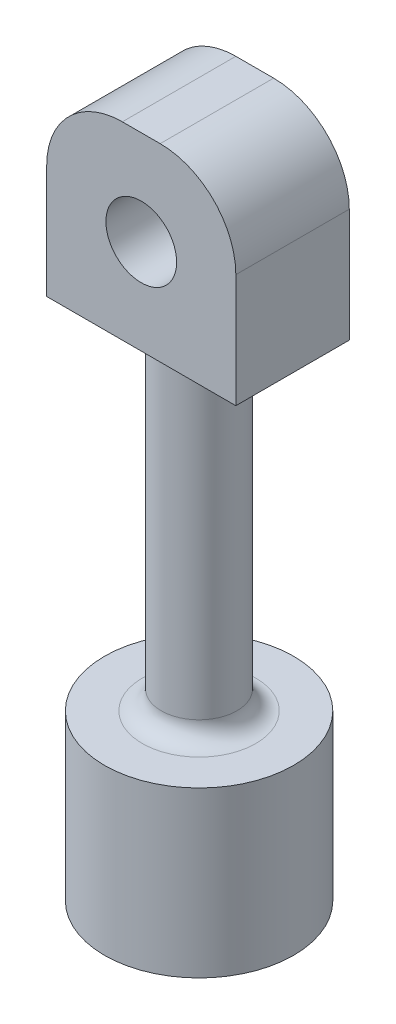
ISO-10303-21;
HEADER;
FILE_DESCRIPTION(('STEP AP214'),'2;1');
FILE_NAME('part.step','',(''),(''),'','','');
FILE_SCHEMA(('AUTOMOTIVE_DESIGN { 1 0 10303 214 1 1 1 1 }'));
ENDSEC;
DATA;
#1=APPLICATION_CONTEXT('core data for automotive mechanical design processes');
#2=APPLICATION_PROTOCOL_DEFINITION('international standard','automotive_design',2000,#1);
#3=PRODUCT_CONTEXT('',#1,'mechanical');
#4=PRODUCT('Part','Part','',(#3));
#5=PRODUCT_RELATED_PRODUCT_CATEGORY('part','',(#4));
#6=PRODUCT_DEFINITION_FORMATION('','',#4);
#7=PRODUCT_DEFINITION_CONTEXT('part definition',#1,'design');
#8=PRODUCT_DEFINITION('design','',#6,#7);
#9=PRODUCT_DEFINITION_SHAPE('','',#8);
#10=(LENGTH_UNIT() NAMED_UNIT(*) SI_UNIT(.MILLI.,.METRE.));
#11=(NAMED_UNIT(*) PLANE_ANGLE_UNIT() SI_UNIT($,.RADIAN.));
#12=(NAMED_UNIT(*) SI_UNIT($,.STERADIAN.) SOLID_ANGLE_UNIT());
#13=UNCERTAINTY_MEASURE_WITH_UNIT(LENGTH_MEASURE(1.E-05),#10,'distance_accuracy_value','');
#14=(GEOMETRIC_REPRESENTATION_CONTEXT(3) GLOBAL_UNCERTAINTY_ASSIGNED_CONTEXT((#13)) GLOBAL_UNIT_ASSIGNED_CONTEXT((#10,
#11,#12)) REPRESENTATION_CONTEXT('',''));
#15=CARTESIAN_POINT('',(0.,0.,0.));
#16=DIRECTION('',(0.,0.,1.));
#17=DIRECTION('',(1.,0.,0.));
#18=AXIS2_PLACEMENT_3D('',#15,#16,#17);
#19=CARTESIAN_POINT('',(0.,0.,3.));
#20=DIRECTION('',(0.,0.,1.));
#21=DIRECTION('',(1.,0.,0.));
#22=AXIS2_PLACEMENT_3D('',#19,#20,#21);
#23=PLANE('',#22);
#24=DIRECTION('',(-1.,0.,0.));
#25=VECTOR('',#24,1.);
#26=CARTESIAN_POINT('',(-2.5,2.5,3.));
#27=LINE('',#26,#25);
#28=CARTESIAN_POINT('',(0.5,2.5,3.));
#29=VERTEX_POINT('',#28);
#30=CARTESIAN_POINT('',(-0.5,2.5,3.));
#31=VERTEX_POINT('',#30);
#32=EDGE_CURVE('E124',#29,#31,#27,.T.);
#33=ORIENTED_EDGE('',*,*,#32,.T.);
#34=CARTESIAN_POINT('',(-0.500000000000001,0.5,3.));
#35=DIRECTION('',(0.,0.,1.));
#36=DIRECTION('',(1.,0.,0.));
#37=AXIS2_PLACEMENT_3D('',#34,#35,#36);
#38=CIRCLE('',#37,2.);
#39=CARTESIAN_POINT('',(-2.5,0.499999999999999,3.));
#40=VERTEX_POINT('',#39);
#41=EDGE_CURVE('E119',#31,#40,#38,.T.);
#42=ORIENTED_EDGE('',*,*,#41,.T.);
#43=DIRECTION('',(0.,-1.,0.));
#44=VECTOR('',#43,1.);
#45=CARTESIAN_POINT('',(-2.5,2.5,3.));
#46=LINE('',#45,#44);
#47=CARTESIAN_POINT('',(-2.5,-2.5,3.));
#48=VERTEX_POINT('',#47);
#49=EDGE_CURVE('E110',#40,#48,#46,.T.);
#50=ORIENTED_EDGE('',*,*,#49,.T.);
#51=DIRECTION('',(1.,0.,0.));
#52=VECTOR('',#51,1.);
#53=CARTESIAN_POINT('',(-2.5,-2.5,3.));
#54=LINE('',#53,#52);
#55=CARTESIAN_POINT('',(2.5,-2.5,3.));
#56=VERTEX_POINT('',#55);
#57=EDGE_CURVE('E116',#48,#56,#54,.T.);
#58=ORIENTED_EDGE('',*,*,#57,.T.);
#59=DIRECTION('',(0.,1.,0.));
#60=VECTOR('',#59,1.);
#61=CARTESIAN_POINT('',(2.5,2.5,3.));
#62=LINE('',#61,#60);
#63=CARTESIAN_POINT('',(2.5,0.5,3.));
#64=VERTEX_POINT('',#63);
#65=EDGE_CURVE('E159',#56,#64,#62,.T.);
#66=ORIENTED_EDGE('',*,*,#65,.T.);
#67=CARTESIAN_POINT('',(0.5,0.5,3.));
#68=DIRECTION('',(0.,0.,1.));
#69=DIRECTION('',(1.,0.,0.));
#70=AXIS2_PLACEMENT_3D('',#67,#68,#69);
#71=CIRCLE('',#70,2.);
#72=EDGE_CURVE('E177',#64,#29,#71,.T.);
#73=ORIENTED_EDGE('',*,*,#72,.T.);
#74=EDGE_LOOP('',(#33,#42,#50,#58,#66,#73));
#75=FACE_BOUND('',#74,.T.);
#76=CARTESIAN_POINT('',(0.,0.,3.));
#77=DIRECTION('',(0.,0.,1.));
#78=DIRECTION('',(1.,0.,0.));
#79=AXIS2_PLACEMENT_3D('',#76,#77,#78);
#80=CIRCLE('',#79,0.935);
#81=CARTESIAN_POINT('',(0.934999999999999,0.,3.));
#82=VERTEX_POINT('',#81);
#83=EDGE_CURVE('E150',#82,#82,#80,.T.);
#84=ORIENTED_EDGE('',*,*,#83,.F.);
#85=EDGE_LOOP('',(#84));
#86=FACE_BOUND('',#85,.T.);
#87=ADVANCED_FACE('F43',(#75,#86),#23,.T.);
#88=CARTESIAN_POINT('',(0.,0.,0.));
#89=DIRECTION('',(0.,0.,1.));
#90=DIRECTION('',(1.,0.,0.));
#91=AXIS2_PLACEMENT_3D('',#88,#89,#90);
#92=PLANE('',#91);
#93=DIRECTION('',(0.,-1.,0.));
#94=VECTOR('',#93,1.);
#95=CARTESIAN_POINT('',(-2.5,2.5,0.));
#96=LINE('',#95,#94);
#97=CARTESIAN_POINT('',(-2.5,0.499999999999999,0.));
#98=VERTEX_POINT('',#97);
#99=CARTESIAN_POINT('',(-2.5,-2.5,0.));
#100=VERTEX_POINT('',#99);
#101=EDGE_CURVE('E130',#98,#100,#96,.T.);
#102=ORIENTED_EDGE('',*,*,#101,.F.);
#103=CARTESIAN_POINT('',(-0.500000000000001,0.5,0.));
#104=DIRECTION('',(0.,0.,1.));
#105=DIRECTION('',(1.,0.,0.));
#106=AXIS2_PLACEMENT_3D('',#103,#104,#105);
#107=CIRCLE('',#106,2.);
#108=CARTESIAN_POINT('',(-0.5,2.5,0.));
#109=VERTEX_POINT('',#108);
#110=EDGE_CURVE('E167',#98,#109,#107,.F.);
#111=ORIENTED_EDGE('',*,*,#110,.T.);
#112=DIRECTION('',(-1.,0.,0.));
#113=VECTOR('',#112,1.);
#114=CARTESIAN_POINT('',(-2.5,2.5,0.));
#115=LINE('',#114,#113);
#116=CARTESIAN_POINT('',(0.5,2.5,0.));
#117=VERTEX_POINT('',#116);
#118=EDGE_CURVE('E149',#117,#109,#115,.T.);
#119=ORIENTED_EDGE('',*,*,#118,.F.);
#120=CARTESIAN_POINT('',(0.5,0.5,0.));
#121=DIRECTION('',(0.,0.,1.));
#122=DIRECTION('',(1.,0.,0.));
#123=AXIS2_PLACEMENT_3D('',#120,#121,#122);
#124=CIRCLE('',#123,2.);
#125=CARTESIAN_POINT('',(2.5,0.5,0.));
#126=VERTEX_POINT('',#125);
#127=EDGE_CURVE('E164',#117,#126,#124,.F.);
#128=ORIENTED_EDGE('',*,*,#127,.T.);
#129=DIRECTION('',(0.,1.,0.));
#130=VECTOR('',#129,1.);
#131=CARTESIAN_POINT('',(2.5,2.5,0.));
#132=LINE('',#131,#130);
#133=CARTESIAN_POINT('',(2.5,-2.5,0.));
#134=VERTEX_POINT('',#133);
#135=EDGE_CURVE('E145',#134,#126,#132,.T.);
#136=ORIENTED_EDGE('',*,*,#135,.F.);
#137=DIRECTION('',(1.,0.,0.));
#138=VECTOR('',#137,1.);
#139=CARTESIAN_POINT('',(-2.5,-2.5,0.));
#140=LINE('',#139,#138);
#141=CARTESIAN_POINT('',(0.28959461628921,-2.5,0.));
#142=VERTEX_POINT('',#141);
#143=EDGE_CURVE('E156',#142,#134,#140,.T.);
#144=ORIENTED_EDGE('',*,*,#143,.F.);
#145=CARTESIAN_POINT('',(-0.28959461628921,-2.5,0.));
#146=VERTEX_POINT('',#145);
#147=EDGE_CURVE('E160',#146,#142,#140,.T.);
#148=ORIENTED_EDGE('',*,*,#147,.F.);
#149=EDGE_CURVE('E157',#100,#146,#140,.T.);
#150=ORIENTED_EDGE('',*,*,#149,.F.);
#151=EDGE_LOOP('',(#102,#111,#119,#128,#136,#144,#148,#150));
#152=FACE_BOUND('',#151,.T.);
#153=CARTESIAN_POINT('',(0.,0.,0.));
#154=DIRECTION('',(0.,0.,1.));
#155=DIRECTION('',(1.,0.,0.));
#156=AXIS2_PLACEMENT_3D('',#153,#154,#155);
#157=CIRCLE('',#156,0.935);
#158=CARTESIAN_POINT('',(0.934999999999999,0.,0.));
#159=VERTEX_POINT('',#158);
#160=EDGE_CURVE('E282',#159,#159,#157,.T.);
#161=ORIENTED_EDGE('',*,*,#160,.T.);
#162=EDGE_LOOP('',(#161));
#163=FACE_BOUND('',#162,.T.);
#164=ADVANCED_FACE('F238',(#152,#163),#92,.F.);
#165=CARTESIAN_POINT('',(2.5,2.5,3.));
#166=DIRECTION('',(-1.,0.,0.));
#167=DIRECTION('',(0.,-1.,0.));
#168=AXIS2_PLACEMENT_3D('',#165,#166,#167);
#169=PLANE('',#168);
#170=ORIENTED_EDGE('',*,*,#135,.T.);
#171=DIRECTION('',(0.,0.,-1.));
#172=VECTOR('',#171,1.);
#173=CARTESIAN_POINT('',(2.5,0.5,3.));
#174=LINE('',#173,#172);
#175=EDGE_CURVE('E182',#126,#64,#174,.F.);
#176=ORIENTED_EDGE('',*,*,#175,.T.);
#177=ORIENTED_EDGE('',*,*,#65,.F.);
#178=DIRECTION('',(0.,0.,-1.));
#179=VECTOR('',#178,1.);
#180=CARTESIAN_POINT('',(2.5,-2.5,3.));
#181=LINE('',#180,#179);
#182=EDGE_CURVE('E134',#56,#134,#181,.T.);
#183=ORIENTED_EDGE('',*,*,#182,.T.);
#184=EDGE_LOOP('',(#170,#176,#177,#183));
#185=FACE_BOUND('',#184,.T.);
#186=ADVANCED_FACE('F243',(#185),#169,.F.);
#187=CARTESIAN_POINT('',(-2.5,2.5,3.));
#188=DIRECTION('',(0.,-1.,0.));
#189=DIRECTION('',(0.,0.,-1.));
#190=AXIS2_PLACEMENT_3D('',#187,#188,#189);
#191=PLANE('',#190);
#192=ORIENTED_EDGE('',*,*,#118,.T.);
#193=DIRECTION('',(0.,0.,-1.));
#194=VECTOR('',#193,1.);
#195=CARTESIAN_POINT('',(-0.5,2.5,3.));
#196=LINE('',#195,#194);
#197=EDGE_CURVE('E174',#109,#31,#196,.F.);
#198=ORIENTED_EDGE('',*,*,#197,.T.);
#199=ORIENTED_EDGE('',*,*,#32,.F.);
#200=DIRECTION('',(0.,0.,-1.));
#201=VECTOR('',#200,1.);
#202=CARTESIAN_POINT('',(0.5,2.5,3.));
#203=LINE('',#202,#201);
#204=EDGE_CURVE('E170',#29,#117,#203,.T.);
#205=ORIENTED_EDGE('',*,*,#204,.T.);
#206=EDGE_LOOP('',(#192,#198,#199,#205));
#207=FACE_BOUND('',#206,.T.);
#208=ADVANCED_FACE('F252',(#207),#191,.F.);
#209=CARTESIAN_POINT('',(-2.5,2.5,3.));
#210=DIRECTION('',(1.,0.,0.));
#211=DIRECTION('',(0.,1.,0.));
#212=AXIS2_PLACEMENT_3D('',#209,#210,#211);
#213=PLANE('',#212);
#214=ORIENTED_EDGE('',*,*,#49,.F.);
#215=DIRECTION('',(0.,0.,-1.));
#216=VECTOR('',#215,1.);
#217=CARTESIAN_POINT('',(-2.5,0.499999999999999,3.));
#218=LINE('',#217,#216);
#219=EDGE_CURVE('E133',#40,#98,#218,.T.);
#220=ORIENTED_EDGE('',*,*,#219,.T.);
#221=ORIENTED_EDGE('',*,*,#101,.T.);
#222=DIRECTION('',(0.,0.,-1.));
#223=VECTOR('',#222,1.);
#224=CARTESIAN_POINT('',(-2.5,-2.5,3.));
#225=LINE('',#224,#223);
#226=EDGE_CURVE('E127',#48,#100,#225,.T.);
#227=ORIENTED_EDGE('',*,*,#226,.F.);
#228=EDGE_LOOP('',(#214,#220,#221,#227));
#229=FACE_BOUND('',#228,.T.);
#230=ADVANCED_FACE('F128',(#229),#213,.F.);
#231=CARTESIAN_POINT('',(-2.5,-2.5,3.));
#232=DIRECTION('',(0.,1.,0.));
#233=DIRECTION('',(0.,0.,1.));
#234=AXIS2_PLACEMENT_3D('',#231,#232,#233);
#235=PLANE('',#234);
#236=ORIENTED_EDGE('',*,*,#149,.T.);
#237=CARTESIAN_POINT('',(0.,-2.5,1.47177952092571));
#238=DIRECTION('',(0.,1.,0.));
#239=DIRECTION('',(0.,0.,1.));
#240=AXIS2_PLACEMENT_3D('',#237,#238,#239);
#241=CIRCLE('',#240,1.5);
#242=EDGE_CURVE('E59',#146,#142,#241,.T.);
#243=ORIENTED_EDGE('',*,*,#242,.T.);
#244=ORIENTED_EDGE('',*,*,#143,.T.);
#245=ORIENTED_EDGE('',*,*,#182,.F.);
#246=ORIENTED_EDGE('',*,*,#57,.F.);
#247=ORIENTED_EDGE('',*,*,#226,.T.);
#248=EDGE_LOOP('',(#236,#243,#244,#245,#246,#247));
#249=FACE_BOUND('',#248,.T.);
#250=ADVANCED_FACE('F136',(#249),#235,.F.);
#251=CARTESIAN_POINT('',(0.,0.,3.));
#252=DIRECTION('',(0.,0.,-1.));
#253=DIRECTION('',(-1.,0.,0.));
#254=AXIS2_PLACEMENT_3D('',#251,#252,#253);
#255=CYLINDRICAL_SURFACE('',#254,0.935);
#256=ORIENTED_EDGE('',*,*,#83,.T.);
#257=EDGE_LOOP('',(#256));
#258=FACE_BOUND('',#257,.T.);
#259=ORIENTED_EDGE('',*,*,#160,.F.);
#260=EDGE_LOOP('',(#259));
#261=FACE_BOUND('',#260,.T.);
#262=ADVANCED_FACE('F245',(#258,#261),#255,.F.);
#263=CARTESIAN_POINT('',(-0.500000000000001,0.5,3.));
#264=DIRECTION('',(0.,0.,-1.));
#265=DIRECTION('',(-1.,0.,0.));
#266=AXIS2_PLACEMENT_3D('',#263,#264,#265);
#267=CYLINDRICAL_SURFACE('',#266,2.);
#268=ORIENTED_EDGE('',*,*,#41,.F.);
#269=ORIENTED_EDGE('',*,*,#197,.F.);
#270=ORIENTED_EDGE('',*,*,#110,.F.);
#271=ORIENTED_EDGE('',*,*,#219,.F.);
#272=EDGE_LOOP('',(#268,#269,#270,#271));
#273=FACE_BOUND('',#272,.T.);
#274=ADVANCED_FACE('F258',(#273),#267,.T.);
#275=CARTESIAN_POINT('',(0.5,0.5,3.));
#276=DIRECTION('',(0.,0.,-1.));
#277=DIRECTION('',(-1.,0.,0.));
#278=AXIS2_PLACEMENT_3D('',#275,#276,#277);
#279=CYLINDRICAL_SURFACE('',#278,2.);
#280=ORIENTED_EDGE('',*,*,#72,.F.);
#281=ORIENTED_EDGE('',*,*,#175,.F.);
#282=ORIENTED_EDGE('',*,*,#127,.F.);
#283=ORIENTED_EDGE('',*,*,#204,.F.);
#284=EDGE_LOOP('',(#280,#281,#282,#283));
#285=FACE_BOUND('',#284,.T.);
#286=ADVANCED_FACE('F206',(#285),#279,.T.);
#287=CARTESIAN_POINT('',(0.,-11.5,1.47177952092571));
#288=DIRECTION('',(0.,1.,0.));
#289=DIRECTION('',(0.,0.,1.));
#290=AXIS2_PLACEMENT_3D('',#287,#288,#289);
#291=CYLINDRICAL_SURFACE('',#290,1.);
#292=CARTESIAN_POINT('',(0.,-11.,1.47177952092571));
#293=DIRECTION('',(0.,-1.,0.));
#294=DIRECTION('',(0.,0.,-1.));
#295=AXIS2_PLACEMENT_3D('',#292,#293,#294);
#296=CIRCLE('',#295,1.);
#297=CARTESIAN_POINT('',(0.,-11.,0.471779520925708));
#298=VERTEX_POINT('',#297);
#299=EDGE_CURVE('E11',#298,#298,#296,.F.);
#300=ORIENTED_EDGE('',*,*,#299,.T.);
#301=EDGE_LOOP('',(#300));
#302=FACE_BOUND('',#301,.T.);
#303=CARTESIAN_POINT('',(0.,-3.,1.47177952092571));
#304=DIRECTION('',(0.,1.,0.));
#305=DIRECTION('',(0.,0.,1.));
#306=AXIS2_PLACEMENT_3D('',#303,#304,#305);
#307=CIRCLE('',#306,1.);
#308=CARTESIAN_POINT('',(0.19306307752614,-3.,0.490593173641903));
#309=VERTEX_POINT('',#308);
#310=CARTESIAN_POINT('',(-0.19306307752614,-3.,0.490593173641903));
#311=VERTEX_POINT('',#310);
#312=EDGE_CURVE('E185',#309,#311,#307,.F.);
#313=ORIENTED_EDGE('',*,*,#312,.T.);
#314=CARTESIAN_POINT('',(-0.394649196927574,-2.99117391933789,0.552947647640708));
#315=CARTESIAN_POINT('',(-0.353693643942351,-2.39805478062536,0.535356751454709));
#316=CARTESIAN_POINT('',(-0.59197379539136,-2.5,0.));
#317=CARTESIAN_POINT('',(-0.370003309675261,-2.99416371790136,0.542356971420473));
#318=CARTESIAN_POINT('',(-0.339699059370028,-2.41668623299627,0.530521939380084));
#319=CARTESIAN_POINT('',(-0.55500496451738,-2.5,0.));
#320=CARTESIAN_POINT('',(-0.344898482704944,-2.99614425941602,0.532753585620251));
#321=CARTESIAN_POINT('',(-0.322372048212822,-2.43316340962878,0.524624039190875));
#322=CARTESIAN_POINT('',(-0.517347724062306,-2.5,0.));
#323=CARTESIAN_POINT('',(-0.29398371980754,-2.99876845633937,0.515593189814388));
#324=CARTESIAN_POINT('',(-0.28330515575148,-2.46146818114067,0.51251541352741));
#325=CARTESIAN_POINT('',(-0.440975579714359,-2.5,0.));
#326=CARTESIAN_POINT('',(-0.268174238797704,-2.99941295453052,0.508034892375565));
#327=CARTESIAN_POINT('',(-0.261571554081147,-2.47349508623127,0.506279227403994));
#328=CARTESIAN_POINT('',(-0.402261358197364,-2.5,0.));
#329=CARTESIAN_POINT('',(-0.216687035794963,-3.00004074862928,0.495186561581661));
#330=CARTESIAN_POINT('',(-0.215696444804625,-2.49320564129651,0.495042801752366));
#331=CARTESIAN_POINT('',(-0.325030553691658,-2.5,0.));
#332=CARTESIAN_POINT('',(-0.191022325140719,-3.00004026611496,0.489844262177281));
#333=CARTESIAN_POINT('',(-0.191563900261327,-2.50111511474736,0.489966785033477));
#334=CARTESIAN_POINT('',(-0.286533487710869,-2.5,0.));
#335=CARTESIAN_POINT('',(-0.139350234990815,-2.99984377966152,0.481190008860704));
#336=CARTESIAN_POINT('',(-0.141569786361463,-2.51360070855744,0.481530339187926));
#337=CARTESIAN_POINT('',(-0.209025352486435,-2.5,0.));
#338=CARTESIAN_POINT('',(-0.113342820340311,-2.99964775550707,0.477878264926985));
#339=CARTESIAN_POINT('',(-0.11558467627708,-2.51825450811005,0.478124097914169));
#340=CARTESIAN_POINT('',(-0.170014230510524,-2.5,0.));
#341=CARTESIAN_POINT('',(-0.0605927201146945,-2.9993358805855,0.47325844761114));
#342=CARTESIAN_POINT('',(-0.0622670494954202,-2.52465435181473,0.473354876412366));
#343=CARTESIAN_POINT('',(-0.0908890801719827,-2.5,0.));
#344=CARTESIAN_POINT('',(-0.0338461579379569,-2.99922182295986,0.47199447045906));
#345=CARTESIAN_POINT('',(-0.034754945863027,-2.52637725661052,0.472007339712035));
#346=CARTESIAN_POINT('',(-0.0507692369069183,-2.5,0.));
#347=CARTESIAN_POINT('',(0.0196623850904715,-2.99918837793747,0.471614866877057));
#348=CARTESIAN_POINT('',(0.0201776832265609,-2.52689447059911,0.471604791821669));
#349=CARTESIAN_POINT('',(0.0294935776356898,-2.5,0.));
#350=CARTESIAN_POINT('',(0.0464243661439426,-2.99926899314897,0.472499269231275));
#351=CARTESIAN_POINT('',(0.0477692629829025,-2.52569196123049,0.472547297434953));
#352=CARTESIAN_POINT('',(0.0696365492159041,-2.5,0.));
#353=CARTESIAN_POINT('',(0.100488997190159,-2.99956218964551,0.476462837977408));
#354=CARTESIAN_POINT('',(0.10268015443219,-2.52022741676792,0.476675638912733));
#355=CARTESIAN_POINT('',(0.150733495785249,-2.5,0.));
#356=CARTESIAN_POINT('',(0.127787492826724,-2.9997781655869,0.479598773670447));
#357=CARTESIAN_POINT('',(0.130144108361612,-2.51585028507677,0.479946206772969));
#358=CARTESIAN_POINT('',(0.191681239240108,-2.5,0.));
#359=CARTESIAN_POINT('',(0.182036984409509,-3.00001727551045,0.488103797286586));
#360=CARTESIAN_POINT('',(0.183044066590521,-2.50365997016081,0.488284074164526));
#361=CARTESIAN_POINT('',(0.273055476614294,-2.5,0.));
#362=CARTESIAN_POINT('',(0.20898794936506,-3.00004039241174,0.493473082965719));
#363=CARTESIAN_POINT('',(0.208626987240739,-2.49576333877356,0.493401418629375));
#364=CARTESIAN_POINT('',(0.313481924047616,-2.5,0.));
#365=CARTESIAN_POINT('',(0.23567154612322,-2.99980310983892,0.499946756326833));
#366=CARTESIAN_POINT('',(0.232368034914394,-2.48598808211921,0.499145647717843));
#367=CARTESIAN_POINT('',(0.35350731918483,-2.5,0.));
#368=(BOUNDED_SURFACE() B_SPLINE_SURFACE(3,2,((#314,#315,#316),(#317,#318,#319),(#320,#321,
#322),(#323,#324,#325),(#326,#327,#328),(#329,#330,#331),(#332,#333,#334),(#335,#336,#337),
(#338,#339,#340),(#341,#342,#343),(#344,#345,#346),(#347,#348,#349),(#350,#351,#352),(#353,#354,
#355),(#356,#357,#358),(#359,#360,#361),(#362,#363,#364),(#365,#366,#367)),.UNSPECIFIED.,.F.,
.F.,.F.) B_SPLINE_SURFACE_WITH_KNOTS((4,2,2,2,2,2,2,2,4),(3,3),(0.,0.120962925839149,
0.241849524443708,0.359695825043062,0.477554310000645,0.597918539274731,0.718284381206204,
0.841796725234962,0.965320008217604),(0.,1.),
.UNSPECIFIED.) GEOMETRIC_REPRESENTATION_ITEM() RATIONAL_B_SPLINE_SURFACE(((1.,0.643475005553413,
1.),(1.,0.654056197906712,1.),(1.,0.663765357140396,1.),(1.,0.681253268379087,1.),(1.,
0.689033234599353,1.),(1.,0.702321005941068,1.),(1.,0.707881034911251,1.),(1.,0.716912926601534,
1.),(1.,0.720384573362628,1.),(1.,0.725232023495571,1.),(1.,0.726561698707511,1.),(1.,
0.726960985974508,1.),(1.,0.726030567748673,1.),(1.,0.721868435690301,1.),(1.,0.718577199143816,
1.),(1.,0.709695537542287,1.),(1.,0.70410490888388,1.),(1.,0.697398611140429,1.))) REPRESENTATION_ITEM('') SURFACE());
#369=CARTESIAN_POINT('',(-0.394649196927574,-2.99117391933789,0.552947647640708));
#370=CARTESIAN_POINT('',(-0.370003309675261,-2.99416371790136,0.542356971420473));
#371=CARTESIAN_POINT('',(-0.344898482704944,-2.99614425941602,0.532753585620251));
#372=CARTESIAN_POINT('',(-0.29398371980754,-2.99876845633937,0.515593189814388));
#373=CARTESIAN_POINT('',(-0.268174238797704,-2.99941295453052,0.508034892375565));
#374=CARTESIAN_POINT('',(-0.216687035794963,-3.00004074862928,0.495186561581661));
#375=CARTESIAN_POINT('',(-0.191022325140719,-3.00004026611496,0.489844262177281));
#376=CARTESIAN_POINT('',(-0.139350234990815,-2.99984377966152,0.481190008860704));
#377=CARTESIAN_POINT('',(-0.113342820340311,-2.99964775550707,0.477878264926985));
#378=CARTESIAN_POINT('',(-0.0605927201146945,-2.9993358805855,0.47325844761114));
#379=CARTESIAN_POINT('',(-0.0338461579379569,-2.99922182295986,0.47199447045906));
#380=CARTESIAN_POINT('',(0.0196623850904715,-2.99918837793747,0.471614866877057));
#381=CARTESIAN_POINT('',(0.0464243661439426,-2.99926899314897,0.472499269231275));
#382=CARTESIAN_POINT('',(0.100488997190159,-2.99956218964551,0.476462837977408));
#383=CARTESIAN_POINT('',(0.127787492826724,-2.9997781655869,0.479598773670447));
#384=CARTESIAN_POINT('',(0.182036984409509,-3.00001727551045,0.488103797286586));
#385=CARTESIAN_POINT('',(0.20898794936506,-3.00004039241174,0.493473082965719));
#386=CARTESIAN_POINT('',(0.23567154612322,-2.99980310983892,0.499946756326833));
#387=B_SPLINE_CURVE_WITH_KNOTS('',3,(#369,#370,#371,#372,#373,#374,#375,#376,#377,#378,#379,
#380,#381,#382,#383,#384,#385,#386),.UNSPECIFIED.,.F.,.F.,(4,2,2,2,2,2,2,2,4),(0.,
0.120962925839149,0.241849524443708,0.359695825043062,0.477554310000645,0.597918539274731,
0.718284381206204,0.841796725234962,0.965320008217604),.UNSPECIFIED.);
#388=EDGE_CURVE('E188',#311,#309,#387,.T.);
#389=ORIENTED_EDGE('',*,*,#388,.T.);
#390=EDGE_LOOP('',(#313,#389));
#391=FACE_BOUND('',#390,.T.);
#392=ADVANCED_FACE('F199',(#302,#391),#291,.T.);
#393=CARTESIAN_POINT('',(0.,-3.,1.47177952092571));
#394=DIRECTION('',(0.,1.,0.));
#395=DIRECTION('',(0.,0.,1.));
#396=AXIS2_PLACEMENT_3D('',#393,#394,#395);
#397=TOROIDAL_SURFACE('',#396,1.5,0.5);
#398=CARTESIAN_POINT('',(0.28959461628921,-3.,0.));
#399=DIRECTION('',(0.981186347283805,0.,0.19306307752614));
#400=DIRECTION('',(0.19306307752614,0.,-0.981186347283805));
#401=AXIS2_PLACEMENT_3D('',#398,#399,#400);
#402=CIRCLE('',#401,0.5);
#403=EDGE_CURVE('E296',#142,#309,#402,.T.);
#404=ORIENTED_EDGE('',*,*,#403,.F.);
#405=ORIENTED_EDGE('',*,*,#242,.F.);
#406=CARTESIAN_POINT('',(-0.28959461628921,-3.,0.));
#407=DIRECTION('',(-0.981186347283805,0.,0.19306307752614));
#408=DIRECTION('',(0.19306307752614,0.,0.981186347283805));
#409=AXIS2_PLACEMENT_3D('',#406,#407,#408);
#410=CIRCLE('',#409,0.5);
#411=EDGE_CURVE('E67',#311,#146,#410,.T.);
#412=ORIENTED_EDGE('',*,*,#411,.F.);
#413=ORIENTED_EDGE('',*,*,#312,.F.);
#414=EDGE_LOOP('',(#404,#405,#412,#413));
#415=FACE_BOUND('',#414,.T.);
#416=ADVANCED_FACE('F214',(#415),#397,.F.);
#417=ORIENTED_EDGE('',*,*,#411,.T.);
#418=ORIENTED_EDGE('',*,*,#147,.T.);
#419=ORIENTED_EDGE('',*,*,#403,.T.);
#420=ORIENTED_EDGE('',*,*,#388,.F.);
#421=EDGE_LOOP('',(#417,#418,#419,#420));
#422=FACE_BOUND('',#421,.T.);
#423=ADVANCED_FACE('F208',(#422),#368,.F.);
#424=CARTESIAN_POINT('',(0.,-15.85,1.47177952092571));
#425=DIRECTION('',(0.,1.,0.));
#426=DIRECTION('',(0.,0.,1.));
#427=AXIS2_PLACEMENT_3D('',#424,#425,#426);
#428=CYLINDRICAL_SURFACE('',#427,2.5);
#429=CARTESIAN_POINT('',(0.,-15.85,1.47177952092571));
#430=DIRECTION('',(0.,-1.,0.));
#431=DIRECTION('',(0.,0.,-1.));
#432=AXIS2_PLACEMENT_3D('',#429,#430,#431);
#433=CIRCLE('',#432,2.5);
#434=CARTESIAN_POINT('',(0.,-15.85,-1.02822047907429));
#435=VERTEX_POINT('',#434);
#436=EDGE_CURVE('E293',#435,#435,#433,.T.);
#437=ORIENTED_EDGE('',*,*,#436,.F.);
#438=EDGE_LOOP('',(#437));
#439=FACE_BOUND('',#438,.T.);
#440=CARTESIAN_POINT('',(0.,-11.5,1.47177952092571));
#441=DIRECTION('',(0.,-1.,0.));
#442=DIRECTION('',(0.,0.,-1.));
#443=AXIS2_PLACEMENT_3D('',#440,#441,#442);
#444=CIRCLE('',#443,2.5);
#445=CARTESIAN_POINT('',(0.,-11.5,-1.02822047907429));
#446=VERTEX_POINT('',#445);
#447=EDGE_CURVE('E289',#446,#446,#444,.T.);
#448=ORIENTED_EDGE('',*,*,#447,.T.);
#449=EDGE_LOOP('',(#448));
#450=FACE_BOUND('',#449,.T.);
#451=ADVANCED_FACE('F213',(#439,#450),#428,.T.);
#452=CARTESIAN_POINT('',(0.,-15.85,1.47177952092571));
#453=DIRECTION('',(0.,-1.,0.));
#454=DIRECTION('',(0.,0.,-1.));
#455=AXIS2_PLACEMENT_3D('',#452,#453,#454);
#456=PLANE('',#455);
#457=ORIENTED_EDGE('',*,*,#436,.T.);
#458=EDGE_LOOP('',(#457));
#459=FACE_BOUND('',#458,.T.);
#460=ADVANCED_FACE('F316',(#459),#456,.T.);
#461=CARTESIAN_POINT('',(0.,-11.5,1.47177952092571));
#462=DIRECTION('',(0.,-1.,0.));
#463=DIRECTION('',(0.,0.,-1.));
#464=AXIS2_PLACEMENT_3D('',#461,#462,#463);
#465=PLANE('',#464);
#466=CARTESIAN_POINT('',(0.,-11.5,1.47177952092571));
#467=DIRECTION('',(0.,-1.,0.));
#468=DIRECTION('',(0.,0.,-1.));
#469=AXIS2_PLACEMENT_3D('',#466,#467,#468);
#470=CIRCLE('',#469,1.5);
#471=CARTESIAN_POINT('',(0.,-11.5,-0.0282204790742924));
#472=VERTEX_POINT('',#471);
#473=EDGE_CURVE('E52',#472,#472,#470,.T.);
#474=ORIENTED_EDGE('',*,*,#473,.T.);
#475=EDGE_LOOP('',(#474));
#476=FACE_BOUND('',#475,.T.);
#477=ORIENTED_EDGE('',*,*,#447,.F.);
#478=EDGE_LOOP('',(#477));
#479=FACE_BOUND('',#478,.T.);
#480=ADVANCED_FACE('F308',(#476,#479),#465,.F.);
#481=CARTESIAN_POINT('',(0.,-11.,1.47177952092571));
#482=DIRECTION('',(0.,-1.,0.));
#483=DIRECTION('',(0.,0.,-1.));
#484=AXIS2_PLACEMENT_3D('',#481,#482,#483);
#485=TOROIDAL_SURFACE('',#484,1.5,0.5);
#486=ORIENTED_EDGE('',*,*,#299,.F.);
#487=EDGE_LOOP('',(#486));
#488=FACE_BOUND('',#487,.T.);
#489=ORIENTED_EDGE('',*,*,#473,.F.);
#490=EDGE_LOOP('',(#489));
#491=FACE_BOUND('',#490,.T.);
#492=ADVANCED_FACE('F45',(#488,#491),#485,.F.);
#493=CLOSED_SHELL('',(#87,#164,#186,#208,#230,#250,#262,#274,#286,#392,#416,#423,#451,#460,#480,#492));
#494=MANIFOLD_SOLID_BREP('B2',#493);
#495=ADVANCED_BREP_SHAPE_REPRESENTATION('',(#18,#494),#14);
#496=SHAPE_DEFINITION_REPRESENTATION(#9,#495);
ENDSEC;
END-ISO-10303-21;
